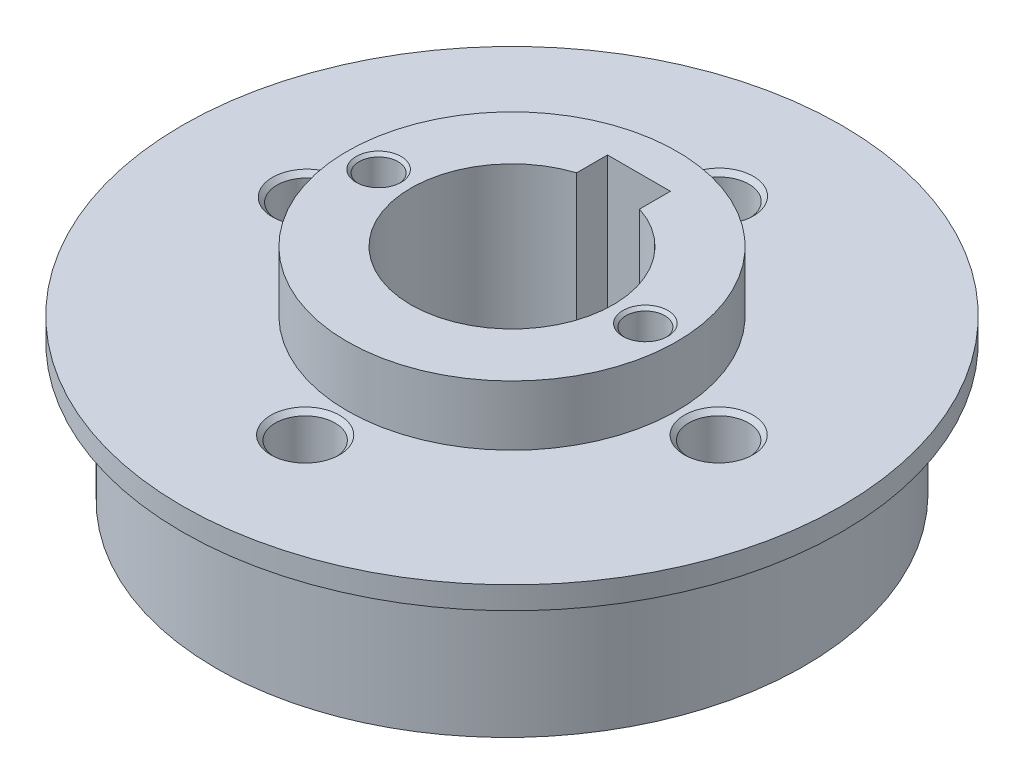
ISO-10303-21;
HEADER;
FILE_DESCRIPTION(('STEP AP214'),'2;1');
FILE_NAME('part.step','',(''),(''),'','','');
FILE_SCHEMA(('AUTOMOTIVE_DESIGN { 1 0 10303 214 1 1 1 1 }'));
ENDSEC;
DATA;
#1=APPLICATION_CONTEXT('core data for automotive mechanical design processes');
#2=APPLICATION_PROTOCOL_DEFINITION('international standard','automotive_design',2000,#1);
#3=PRODUCT_CONTEXT('',#1,'mechanical');
#4=PRODUCT('Part','Part','',(#3));
#5=PRODUCT_RELATED_PRODUCT_CATEGORY('part','',(#4));
#6=PRODUCT_DEFINITION_FORMATION('','',#4);
#7=PRODUCT_DEFINITION_CONTEXT('part definition',#1,'design');
#8=PRODUCT_DEFINITION('design','',#6,#7);
#9=PRODUCT_DEFINITION_SHAPE('','',#8);
#10=(LENGTH_UNIT() NAMED_UNIT(*) SI_UNIT(.MILLI.,.METRE.));
#11=(NAMED_UNIT(*) PLANE_ANGLE_UNIT() SI_UNIT($,.RADIAN.));
#12=(NAMED_UNIT(*) SI_UNIT($,.STERADIAN.) SOLID_ANGLE_UNIT());
#13=UNCERTAINTY_MEASURE_WITH_UNIT(LENGTH_MEASURE(1.E-05),#10,'distance_accuracy_value','');
#14=(GEOMETRIC_REPRESENTATION_CONTEXT(3) GLOBAL_UNCERTAINTY_ASSIGNED_CONTEXT((#13)) GLOBAL_UNIT_ASSIGNED_CONTEXT((#10,
#11,#12)) REPRESENTATION_CONTEXT('',''));
#15=CARTESIAN_POINT('',(0.,0.,0.));
#16=DIRECTION('',(0.,0.,1.));
#17=DIRECTION('',(1.,0.,0.));
#18=AXIS2_PLACEMENT_3D('',#15,#16,#17);
#19=CARTESIAN_POINT('',(0.,13.,0.));
#20=DIRECTION('',(0.,-1.,0.));
#21=DIRECTION('',(0.,0.,1.));
#22=AXIS2_PLACEMENT_3D('',#19,#20,#21);
#23=ELLIPSE('',#22,19.75,19.5);
#24=DIRECTION('',(0.,-1.,0.));
#25=VECTOR('',#24,1.);
#26=SURFACE_OF_LINEAR_EXTRUSION('',#23,#25);
#27=CARTESIAN_POINT('',(0.,13.,19.75));
#28=VERTEX_POINT('',#27);
#29=EDGE_CURVE('E123',#28,#28,#23,.T.);
#30=ORIENTED_EDGE('',*,*,#29,.T.);
#31=EDGE_LOOP('',(#30));
#32=FACE_BOUND('',#31,.T.);
#33=CARTESIAN_POINT('',(0.,4.,0.));
#34=DIRECTION('',(0.,-1.,0.));
#35=DIRECTION('',(0.,0.,1.));
#36=AXIS2_PLACEMENT_3D('',#33,#34,#35);
#37=ELLIPSE('',#36,19.75,19.5);
#38=CARTESIAN_POINT('',(0.,4.,19.75));
#39=VERTEX_POINT('',#38);
#40=EDGE_CURVE('E120',#39,#39,#37,.F.);
#41=ORIENTED_EDGE('',*,*,#40,.T.);
#42=EDGE_LOOP('',(#41));
#43=FACE_BOUND('',#42,.T.);
#44=ADVANCED_FACE('F36',(#32,#43),#26,.T.);
#45=CARTESIAN_POINT('',(0.,18.5,0.));
#46=DIRECTION('',(0.,-1.,0.));
#47=DIRECTION('',(0.,0.,-1.));
#48=AXIS2_PLACEMENT_3D('',#45,#46,#47);
#49=CYLINDRICAL_SURFACE('',#48,22.);
#50=CARTESIAN_POINT('',(0.,14.5,0.));
#51=DIRECTION('',(0.,1.,0.));
#52=DIRECTION('',(0.,0.,1.));
#53=AXIS2_PLACEMENT_3D('',#50,#51,#52);
#54=CIRCLE('',#53,22.);
#55=CARTESIAN_POINT('',(0.,14.5,22.));
#56=VERTEX_POINT('',#55);
#57=EDGE_CURVE('E226',#56,#56,#54,.T.);
#58=ORIENTED_EDGE('',*,*,#57,.F.);
#59=EDGE_LOOP('',(#58));
#60=FACE_BOUND('',#59,.T.);
#61=CARTESIAN_POINT('',(0.,13.,0.));
#62=DIRECTION('',(0.,-1.,0.));
#63=DIRECTION('',(0.,0.,-1.));
#64=AXIS2_PLACEMENT_3D('',#61,#62,#63);
#65=CIRCLE('',#64,22.);
#66=CARTESIAN_POINT('',(0.,13.,-22.));
#67=VERTEX_POINT('',#66);
#68=EDGE_CURVE('E127',#67,#67,#65,.T.);
#69=ORIENTED_EDGE('',*,*,#68,.F.);
#70=EDGE_LOOP('',(#69));
#71=FACE_BOUND('',#70,.T.);
#72=ADVANCED_FACE('F133',(#60,#71),#49,.T.);
#73=CARTESIAN_POINT('',(0.,14.5,0.));
#74=DIRECTION('',(0.,1.,0.));
#75=DIRECTION('',(0.,0.,1.));
#76=AXIS2_PLACEMENT_3D('',#73,#74,#75);
#77=PLANE('',#76);
#78=CARTESIAN_POINT('',(-13.6907550695712,14.5,0.));
#79=DIRECTION('',(0.,1.,0.));
#80=DIRECTION('',(0.,0.,1.));
#81=AXIS2_PLACEMENT_3D('',#78,#79,#80);
#82=CIRCLE('',#81,2.29389999999999);
#83=CARTESIAN_POINT('',(-13.6907550695712,14.5,2.29389999999999));
#84=VERTEX_POINT('',#83);
#85=EDGE_CURVE('E206',#84,#84,#82,.F.);
#86=ORIENTED_EDGE('',*,*,#85,.T.);
#87=EDGE_LOOP('',(#86));
#88=FACE_BOUND('',#87,.T.);
#89=CARTESIAN_POINT('',(0.,14.5,13.8010392563542));
#90=DIRECTION('',(0.,1.,0.));
#91=DIRECTION('',(0.,0.,1.));
#92=AXIS2_PLACEMENT_3D('',#89,#90,#91);
#93=CIRCLE('',#92,2.29390000000002);
#94=CARTESIAN_POINT('',(0.,14.5,16.0949392563542));
#95=VERTEX_POINT('',#94);
#96=EDGE_CURVE('E211',#95,#95,#93,.F.);
#97=ORIENTED_EDGE('',*,*,#96,.T.);
#98=EDGE_LOOP('',(#97));
#99=FACE_BOUND('',#98,.T.);
#100=CARTESIAN_POINT('',(13.7899190054415,14.5,0.));
#101=DIRECTION('',(0.,1.,0.));
#102=DIRECTION('',(0.,0.,1.));
#103=AXIS2_PLACEMENT_3D('',#100,#101,#102);
#104=CIRCLE('',#103,2.29389999999999);
#105=CARTESIAN_POINT('',(13.7899190054415,14.5,2.29389999999999));
#106=VERTEX_POINT('',#105);
#107=EDGE_CURVE('E272',#106,#106,#104,.F.);
#108=ORIENTED_EDGE('',*,*,#107,.T.);
#109=EDGE_LOOP('',(#108));
#110=FACE_BOUND('',#109,.T.);
#111=CARTESIAN_POINT('',(0.,14.5,-13.8102883154971));
#112=DIRECTION('',(0.,1.,0.));
#113=DIRECTION('',(0.,0.,1.));
#114=AXIS2_PLACEMENT_3D('',#111,#112,#113);
#115=CIRCLE('',#114,2.29389999999999);
#116=CARTESIAN_POINT('',(0.,14.5,-11.5163883154971));
#117=VERTEX_POINT('',#116);
#118=EDGE_CURVE('E269',#117,#117,#115,.F.);
#119=ORIENTED_EDGE('',*,*,#118,.T.);
#120=EDGE_LOOP('',(#119));
#121=FACE_BOUND('',#120,.T.);
#122=CARTESIAN_POINT('',(0.,14.5,0.));
#123=DIRECTION('',(0.,1.,0.));
#124=DIRECTION('',(0.,0.,1.));
#125=AXIS2_PLACEMENT_3D('',#122,#123,#124);
#126=CIRCLE('',#125,11.);
#127=CARTESIAN_POINT('',(0.,14.5,11.));
#128=VERTEX_POINT('',#127);
#129=EDGE_CURVE('E223',#128,#128,#126,.T.);
#130=ORIENTED_EDGE('',*,*,#129,.F.);
#131=EDGE_LOOP('',(#130));
#132=FACE_BOUND('',#131,.T.);
#133=ORIENTED_EDGE('',*,*,#57,.T.);
#134=EDGE_LOOP('',(#133));
#135=FACE_BOUND('',#134,.T.);
#136=ADVANCED_FACE('F145',(#88,#99,#110,#121,#132,#135),#77,.T.);
#137=CARTESIAN_POINT('',(0.,14.5,0.));
#138=DIRECTION('',(0.,1.,0.));
#139=DIRECTION('',(0.,0.,1.));
#140=AXIS2_PLACEMENT_3D('',#137,#138,#139);
#141=CYLINDRICAL_SURFACE('',#140,11.);
#142=ORIENTED_EDGE('',*,*,#129,.T.);
#143=EDGE_LOOP('',(#142));
#144=FACE_BOUND('',#143,.T.);
#145=CARTESIAN_POINT('',(0.,18.5,0.));
#146=DIRECTION('',(0.,1.,0.));
#147=DIRECTION('',(0.,0.,1.));
#148=AXIS2_PLACEMENT_3D('',#145,#146,#147);
#149=CIRCLE('',#148,11.);
#150=CARTESIAN_POINT('',(0.,18.5,11.));
#151=VERTEX_POINT('',#150);
#152=EDGE_CURVE('E221',#151,#151,#149,.T.);
#153=ORIENTED_EDGE('',*,*,#152,.F.);
#154=EDGE_LOOP('',(#153));
#155=FACE_BOUND('',#154,.T.);
#156=ADVANCED_FACE('F142',(#144,#155),#141,.T.);
#157=CARTESIAN_POINT('',(0.,18.5,0.));
#158=DIRECTION('',(0.,1.,0.));
#159=DIRECTION('',(0.,0.,1.));
#160=AXIS2_PLACEMENT_3D('',#157,#158,#159);
#161=PLANE('',#160);
#162=CARTESIAN_POINT('',(-8.9,18.5,0.));
#163=DIRECTION('',(0.,1.,0.));
#164=DIRECTION('',(0.,0.,1.));
#165=AXIS2_PLACEMENT_3D('',#162,#163,#164);
#166=CIRCLE('',#165,1.5);
#167=CARTESIAN_POINT('',(-8.9,18.5,1.5));
#168=VERTEX_POINT('',#167);
#169=EDGE_CURVE('E44',#168,#168,#166,.F.);
#170=ORIENTED_EDGE('',*,*,#169,.T.);
#171=EDGE_LOOP('',(#170));
#172=FACE_BOUND('',#171,.T.);
#173=CARTESIAN_POINT('',(8.9,18.5,0.));
#174=DIRECTION('',(0.,1.,0.));
#175=DIRECTION('',(0.,0.,1.));
#176=AXIS2_PLACEMENT_3D('',#173,#174,#175);
#177=CIRCLE('',#176,1.5);
#178=CARTESIAN_POINT('',(8.9,18.5,1.5));
#179=VERTEX_POINT('',#178);
#180=EDGE_CURVE('E205',#179,#179,#177,.F.);
#181=ORIENTED_EDGE('',*,*,#180,.T.);
#182=EDGE_LOOP('',(#181));
#183=FACE_BOUND('',#182,.T.);
#184=CARTESIAN_POINT('',(0.,18.5,0.));
#185=DIRECTION('',(0.,1.,0.));
#186=DIRECTION('',(0.,0.,1.));
#187=AXIS2_PLACEMENT_3D('',#184,#185,#186);
#188=CIRCLE('',#187,6.75);
#189=CARTESIAN_POINT('',(-2.09759968355261,18.5,-6.415806696555));
#190=VERTEX_POINT('',#189);
#191=CARTESIAN_POINT('',(2.09759968355261,18.5,-6.415806696555));
#192=VERTEX_POINT('',#191);
#193=EDGE_CURVE('E51',#190,#192,#188,.T.);
#194=ORIENTED_EDGE('',*,*,#193,.F.);
#195=DIRECTION('',(0.,0.,1.));
#196=VECTOR('',#195,1.);
#197=CARTESIAN_POINT('',(-2.09759968355261,18.5,-8.47124520737506));
#198=LINE('',#197,#196);
#199=CARTESIAN_POINT('',(-2.09759968355261,18.5,-8.47124520737506));
#200=VERTEX_POINT('',#199);
#201=EDGE_CURVE('E95',#200,#190,#198,.T.);
#202=ORIENTED_EDGE('',*,*,#201,.F.);
#203=DIRECTION('',(-1.,0.,0.));
#204=VECTOR('',#203,1.);
#205=CARTESIAN_POINT('',(-2.09759968355261,18.5,-8.47124520737506));
#206=LINE('',#205,#204);
#207=CARTESIAN_POINT('',(2.09759968355261,18.5,-8.47124520737506));
#208=VERTEX_POINT('',#207);
#209=EDGE_CURVE('E98',#208,#200,#206,.T.);
#210=ORIENTED_EDGE('',*,*,#209,.F.);
#211=DIRECTION('',(0.,0.,-1.));
#212=VECTOR('',#211,1.);
#213=CARTESIAN_POINT('',(2.09759968355261,18.5,-8.47124520737506));
#214=LINE('',#213,#212);
#215=EDGE_CURVE('E107',#192,#208,#214,.T.);
#216=ORIENTED_EDGE('',*,*,#215,.F.);
#217=EDGE_LOOP('',(#194,#202,#210,#216));
#218=FACE_BOUND('',#217,.T.);
#219=ORIENTED_EDGE('',*,*,#152,.T.);
#220=EDGE_LOOP('',(#219));
#221=FACE_BOUND('',#220,.T.);
#222=ADVANCED_FACE('F140',(#172,#183,#218,#221),#161,.T.);
#223=CARTESIAN_POINT('',(0.,13.,0.));
#224=DIRECTION('',(0.,-1.,0.));
#225=DIRECTION('',(0.,0.,-1.));
#226=AXIS2_PLACEMENT_3D('',#223,#224,#225);
#227=PLANE('',#226);
#228=ORIENTED_EDGE('',*,*,#29,.F.);
#229=EDGE_LOOP('',(#228));
#230=FACE_BOUND('',#229,.T.);
#231=ORIENTED_EDGE('',*,*,#68,.T.);
#232=EDGE_LOOP('',(#231));
#233=FACE_BOUND('',#232,.T.);
#234=ADVANCED_FACE('F137',(#230,#233),#227,.T.);
#235=CARTESIAN_POINT('',(0.,4.,0.));
#236=DIRECTION('',(0.,-1.,0.));
#237=DIRECTION('',(0.,0.,-1.));
#238=AXIS2_PLACEMENT_3D('',#235,#236,#237);
#239=PLANE('',#238);
#240=CARTESIAN_POINT('',(0.,4.,-13.8102883154971));
#241=DIRECTION('',(0.,-1.,0.));
#242=DIRECTION('',(0.,0.,-1.));
#243=AXIS2_PLACEMENT_3D('',#240,#241,#242);
#244=CIRCLE('',#243,2.2939);
#245=CARTESIAN_POINT('',(0.,4.,-16.1041883154971));
#246=VERTEX_POINT('',#245);
#247=EDGE_CURVE('E248',#246,#246,#244,.F.);
#248=ORIENTED_EDGE('',*,*,#247,.T.);
#249=EDGE_LOOP('',(#248));
#250=FACE_BOUND('',#249,.T.);
#251=CARTESIAN_POINT('',(-13.6907550695712,4.,0.));
#252=DIRECTION('',(0.,-1.,0.));
#253=DIRECTION('',(0.,0.,-1.));
#254=AXIS2_PLACEMENT_3D('',#251,#252,#253);
#255=CIRCLE('',#254,2.2939);
#256=CARTESIAN_POINT('',(-13.6907550695712,4.,-2.2939));
#257=VERTEX_POINT('',#256);
#258=EDGE_CURVE('E245',#257,#257,#255,.F.);
#259=ORIENTED_EDGE('',*,*,#258,.T.);
#260=EDGE_LOOP('',(#259));
#261=FACE_BOUND('',#260,.T.);
#262=CARTESIAN_POINT('',(0.,4.,13.8010392563542));
#263=DIRECTION('',(0.,-1.,0.));
#264=DIRECTION('',(0.,0.,-1.));
#265=AXIS2_PLACEMENT_3D('',#262,#263,#264);
#266=CIRCLE('',#265,2.2939);
#267=CARTESIAN_POINT('',(0.,4.,11.5071392563542));
#268=VERTEX_POINT('',#267);
#269=EDGE_CURVE('E242',#268,#268,#266,.F.);
#270=ORIENTED_EDGE('',*,*,#269,.T.);
#271=EDGE_LOOP('',(#270));
#272=FACE_BOUND('',#271,.T.);
#273=CARTESIAN_POINT('',(13.7899190054415,4.,0.));
#274=DIRECTION('',(0.,-1.,0.));
#275=DIRECTION('',(0.,0.,-1.));
#276=AXIS2_PLACEMENT_3D('',#273,#274,#275);
#277=CIRCLE('',#276,2.2939);
#278=CARTESIAN_POINT('',(13.7899190054415,4.,-2.2939));
#279=VERTEX_POINT('',#278);
#280=EDGE_CURVE('E239',#279,#279,#277,.F.);
#281=ORIENTED_EDGE('',*,*,#280,.T.);
#282=EDGE_LOOP('',(#281));
#283=FACE_BOUND('',#282,.T.);
#284=ORIENTED_EDGE('',*,*,#40,.F.);
#285=EDGE_LOOP('',(#284));
#286=FACE_BOUND('',#285,.T.);
#287=CARTESIAN_POINT('',(0.,4.,0.));
#288=DIRECTION('',(0.,-1.,0.));
#289=DIRECTION('',(0.,0.,-1.));
#290=AXIS2_PLACEMENT_3D('',#287,#288,#289);
#291=CIRCLE('',#290,11.);
#292=CARTESIAN_POINT('',(0.,4.,-11.));
#293=VERTEX_POINT('',#292);
#294=EDGE_CURVE('E117',#293,#293,#291,.T.);
#295=ORIENTED_EDGE('',*,*,#294,.F.);
#296=EDGE_LOOP('',(#295));
#297=FACE_BOUND('',#296,.T.);
#298=ADVANCED_FACE('F135',(#250,#261,#272,#283,#286,#297),#239,.T.);
#299=CARTESIAN_POINT('',(0.,4.,0.));
#300=DIRECTION('',(0.,-1.,0.));
#301=DIRECTION('',(0.,0.,-1.));
#302=AXIS2_PLACEMENT_3D('',#299,#300,#301);
#303=CYLINDRICAL_SURFACE('',#302,11.);
#304=ORIENTED_EDGE('',*,*,#294,.T.);
#305=EDGE_LOOP('',(#304));
#306=FACE_BOUND('',#305,.T.);
#307=CARTESIAN_POINT('',(0.,0.,0.));
#308=DIRECTION('',(0.,-1.,0.));
#309=DIRECTION('',(0.,0.,-1.));
#310=AXIS2_PLACEMENT_3D('',#307,#308,#309);
#311=CIRCLE('',#310,11.);
#312=CARTESIAN_POINT('',(0.,0.,-11.));
#313=VERTEX_POINT('',#312);
#314=EDGE_CURVE('E113',#313,#313,#311,.T.);
#315=ORIENTED_EDGE('',*,*,#314,.F.);
#316=EDGE_LOOP('',(#315));
#317=FACE_BOUND('',#316,.T.);
#318=ADVANCED_FACE('F155',(#306,#317),#303,.T.);
#319=CARTESIAN_POINT('',(0.,0.,0.));
#320=DIRECTION('',(0.,1.,0.));
#321=DIRECTION('',(0.,0.,1.));
#322=AXIS2_PLACEMENT_3D('',#319,#320,#321);
#323=PLANE('',#322);
#324=DIRECTION('',(0.,0.,1.));
#325=VECTOR('',#324,1.);
#326=CARTESIAN_POINT('',(-2.09759968355261,0.,-8.47124520737506));
#327=LINE('',#326,#325);
#328=CARTESIAN_POINT('',(-2.09759968355261,0.,-8.47124520737506));
#329=VERTEX_POINT('',#328);
#330=CARTESIAN_POINT('',(-2.09759968355261,0.,-6.415806696555));
#331=VERTEX_POINT('',#330);
#332=EDGE_CURVE('E85',#329,#331,#327,.T.);
#333=ORIENTED_EDGE('',*,*,#332,.T.);
#334=CARTESIAN_POINT('',(0.,0.,0.));
#335=DIRECTION('',(0.,1.,0.));
#336=DIRECTION('',(0.,0.,1.));
#337=AXIS2_PLACEMENT_3D('',#334,#335,#336);
#338=CIRCLE('',#337,6.75);
#339=CARTESIAN_POINT('',(2.09759968355261,0.,-6.415806696555));
#340=VERTEX_POINT('',#339);
#341=EDGE_CURVE('E79',#331,#340,#338,.T.);
#342=ORIENTED_EDGE('',*,*,#341,.T.);
#343=DIRECTION('',(0.,0.,-1.));
#344=VECTOR('',#343,1.);
#345=CARTESIAN_POINT('',(2.09759968355261,0.,-8.47124520737506));
#346=LINE('',#345,#344);
#347=CARTESIAN_POINT('',(2.09759968355261,0.,-8.47124520737506));
#348=VERTEX_POINT('',#347);
#349=EDGE_CURVE('E88',#340,#348,#346,.T.);
#350=ORIENTED_EDGE('',*,*,#349,.T.);
#351=DIRECTION('',(-1.,0.,0.));
#352=VECTOR('',#351,1.);
#353=CARTESIAN_POINT('',(-2.09759968355261,0.,-8.47124520737506));
#354=LINE('',#353,#352);
#355=EDGE_CURVE('E59',#348,#329,#354,.T.);
#356=ORIENTED_EDGE('',*,*,#355,.T.);
#357=EDGE_LOOP('',(#333,#342,#350,#356));
#358=FACE_BOUND('',#357,.T.);
#359=ORIENTED_EDGE('',*,*,#314,.T.);
#360=EDGE_LOOP('',(#359));
#361=FACE_BOUND('',#360,.T.);
#362=ADVANCED_FACE('F92',(#358,#361),#323,.F.);
#363=CARTESIAN_POINT('',(0.,0.,0.));
#364=DIRECTION('',(0.,1.,0.));
#365=DIRECTION('',(0.,0.,1.));
#366=AXIS2_PLACEMENT_3D('',#363,#364,#365);
#367=CYLINDRICAL_SURFACE('',#366,6.75);
#368=ORIENTED_EDGE('',*,*,#193,.T.);
#369=DIRECTION('',(0.,1.,0.));
#370=VECTOR('',#369,1.);
#371=CARTESIAN_POINT('',(2.09759968355261,0.,-6.415806696555));
#372=LINE('',#371,#370);
#373=EDGE_CURVE('E75',#340,#192,#372,.T.);
#374=ORIENTED_EDGE('',*,*,#373,.F.);
#375=ORIENTED_EDGE('',*,*,#341,.F.);
#376=DIRECTION('',(0.,1.,0.));
#377=VECTOR('',#376,1.);
#378=CARTESIAN_POINT('',(-2.09759968355261,0.,-6.415806696555));
#379=LINE('',#378,#377);
#380=EDGE_CURVE('E111',#331,#190,#379,.T.);
#381=ORIENTED_EDGE('',*,*,#380,.T.);
#382=EDGE_LOOP('',(#368,#374,#375,#381));
#383=FACE_BOUND('',#382,.T.);
#384=ADVANCED_FACE('F77',(#383),#367,.F.);
#385=CARTESIAN_POINT('',(-2.09759968355261,0.,-8.47124520737506));
#386=DIRECTION('',(-1.,0.,0.));
#387=DIRECTION('',(0.,0.,1.));
#388=AXIS2_PLACEMENT_3D('',#385,#386,#387);
#389=PLANE('',#388);
#390=ORIENTED_EDGE('',*,*,#201,.T.);
#391=ORIENTED_EDGE('',*,*,#380,.F.);
#392=ORIENTED_EDGE('',*,*,#332,.F.);
#393=DIRECTION('',(0.,1.,0.));
#394=VECTOR('',#393,1.);
#395=CARTESIAN_POINT('',(-2.09759968355261,0.,-8.47124520737506));
#396=LINE('',#395,#394);
#397=EDGE_CURVE('E114',#329,#200,#396,.T.);
#398=ORIENTED_EDGE('',*,*,#397,.T.);
#399=EDGE_LOOP('',(#390,#391,#392,#398));
#400=FACE_BOUND('',#399,.T.);
#401=ADVANCED_FACE('F298',(#400),#389,.F.);
#402=CARTESIAN_POINT('',(-2.09759968355261,0.,-8.47124520737506));
#403=DIRECTION('',(0.,0.,-1.));
#404=DIRECTION('',(-1.,0.,0.));
#405=AXIS2_PLACEMENT_3D('',#402,#403,#404);
#406=PLANE('',#405);
#407=ORIENTED_EDGE('',*,*,#209,.T.);
#408=ORIENTED_EDGE('',*,*,#397,.F.);
#409=ORIENTED_EDGE('',*,*,#355,.F.);
#410=DIRECTION('',(0.,1.,0.));
#411=VECTOR('',#410,1.);
#412=CARTESIAN_POINT('',(2.09759968355261,0.,-8.47124520737506));
#413=LINE('',#412,#411);
#414=EDGE_CURVE('E84',#348,#208,#413,.T.);
#415=ORIENTED_EDGE('',*,*,#414,.T.);
#416=EDGE_LOOP('',(#407,#408,#409,#415));
#417=FACE_BOUND('',#416,.T.);
#418=ADVANCED_FACE('F301',(#417),#406,.F.);
#419=CARTESIAN_POINT('',(2.09759968355261,0.,-8.47124520737506));
#420=DIRECTION('',(1.,0.,0.));
#421=DIRECTION('',(0.,0.,-1.));
#422=AXIS2_PLACEMENT_3D('',#419,#420,#421);
#423=PLANE('',#422);
#424=ORIENTED_EDGE('',*,*,#215,.T.);
#425=ORIENTED_EDGE('',*,*,#414,.F.);
#426=ORIENTED_EDGE('',*,*,#349,.F.);
#427=ORIENTED_EDGE('',*,*,#373,.T.);
#428=EDGE_LOOP('',(#424,#425,#426,#427));
#429=FACE_BOUND('',#428,.T.);
#430=ADVANCED_FACE('F89',(#429),#423,.F.);
#431=CARTESIAN_POINT('',(-13.6907550695712,14.5,0.));
#432=DIRECTION('',(0.,1.,0.));
#433=DIRECTION('',(0.,0.,1.));
#434=AXIS2_PLACEMENT_3D('',#431,#432,#433);
#435=CYLINDRICAL_SURFACE('',#434,1.99389999999999);
#436=CARTESIAN_POINT('',(-13.6907550695712,4.30000000000001,0.));
#437=DIRECTION('',(0.,-1.,0.));
#438=DIRECTION('',(0.,0.,-1.));
#439=AXIS2_PLACEMENT_3D('',#436,#437,#438);
#440=CIRCLE('',#439,1.99389999999999);
#441=CARTESIAN_POINT('',(-13.6907550695712,4.30000000000001,-1.99389999999999));
#442=VERTEX_POINT('',#441);
#443=EDGE_CURVE('E254',#442,#442,#440,.T.);
#444=ORIENTED_EDGE('',*,*,#443,.T.);
#445=EDGE_LOOP('',(#444));
#446=FACE_BOUND('',#445,.T.);
#447=CARTESIAN_POINT('',(-13.6907550695712,14.2,0.));
#448=DIRECTION('',(0.,1.,0.));
#449=DIRECTION('',(0.,0.,1.));
#450=AXIS2_PLACEMENT_3D('',#447,#448,#449);
#451=CIRCLE('',#450,1.99389999999999);
#452=CARTESIAN_POINT('',(-13.6907550695712,14.2,1.99389999999999));
#453=VERTEX_POINT('',#452);
#454=EDGE_CURVE('E251',#453,#453,#451,.T.);
#455=ORIENTED_EDGE('',*,*,#454,.T.);
#456=EDGE_LOOP('',(#455));
#457=FACE_BOUND('',#456,.T.);
#458=ADVANCED_FACE('F284',(#446,#457),#435,.F.);
#459=CARTESIAN_POINT('',(0.,14.5,13.8010392563542));
#460=DIRECTION('',(0.,1.,0.));
#461=DIRECTION('',(0.,0.,1.));
#462=AXIS2_PLACEMENT_3D('',#459,#460,#461);
#463=CYLINDRICAL_SURFACE('',#462,1.99389999999999);
#464=CARTESIAN_POINT('',(0.,4.30000000000001,13.8010392563542));
#465=DIRECTION('',(0.,-1.,0.));
#466=DIRECTION('',(0.,0.,-1.));
#467=AXIS2_PLACEMENT_3D('',#464,#465,#466);
#468=CIRCLE('',#467,1.99389999999999);
#469=CARTESIAN_POINT('',(0.,4.30000000000001,11.8071392563542));
#470=VERTEX_POINT('',#469);
#471=EDGE_CURVE('E260',#470,#470,#468,.T.);
#472=ORIENTED_EDGE('',*,*,#471,.T.);
#473=EDGE_LOOP('',(#472));
#474=FACE_BOUND('',#473,.T.);
#475=CARTESIAN_POINT('',(0.,14.2,13.8010392563542));
#476=DIRECTION('',(0.,1.,0.));
#477=DIRECTION('',(0.,0.,1.));
#478=AXIS2_PLACEMENT_3D('',#475,#476,#477);
#479=CIRCLE('',#478,1.99389999999999);
#480=CARTESIAN_POINT('',(0.,14.2,15.7949392563542));
#481=VERTEX_POINT('',#480);
#482=EDGE_CURVE('E257',#481,#481,#479,.T.);
#483=ORIENTED_EDGE('',*,*,#482,.T.);
#484=EDGE_LOOP('',(#483));
#485=FACE_BOUND('',#484,.T.);
#486=ADVANCED_FACE('F281',(#474,#485),#463,.F.);
#487=CARTESIAN_POINT('',(13.7899190054415,14.5,0.));
#488=DIRECTION('',(0.,1.,0.));
#489=DIRECTION('',(0.,0.,1.));
#490=AXIS2_PLACEMENT_3D('',#487,#488,#489);
#491=CYLINDRICAL_SURFACE('',#490,1.99389999999999);
#492=CARTESIAN_POINT('',(13.7899190054415,4.30000000000001,0.));
#493=DIRECTION('',(0.,-1.,0.));
#494=DIRECTION('',(0.,0.,-1.));
#495=AXIS2_PLACEMENT_3D('',#492,#493,#494);
#496=CIRCLE('',#495,1.99389999999999);
#497=CARTESIAN_POINT('',(13.7899190054415,4.30000000000001,-1.99389999999999));
#498=VERTEX_POINT('',#497);
#499=EDGE_CURVE('E266',#498,#498,#496,.T.);
#500=ORIENTED_EDGE('',*,*,#499,.T.);
#501=EDGE_LOOP('',(#500));
#502=FACE_BOUND('',#501,.T.);
#503=CARTESIAN_POINT('',(13.7899190054415,14.2,0.));
#504=DIRECTION('',(0.,1.,0.));
#505=DIRECTION('',(0.,0.,1.));
#506=AXIS2_PLACEMENT_3D('',#503,#504,#505);
#507=CIRCLE('',#506,1.99389999999999);
#508=CARTESIAN_POINT('',(13.7899190054415,14.2,1.99389999999999));
#509=VERTEX_POINT('',#508);
#510=EDGE_CURVE('E263',#509,#509,#507,.T.);
#511=ORIENTED_EDGE('',*,*,#510,.T.);
#512=EDGE_LOOP('',(#511));
#513=FACE_BOUND('',#512,.T.);
#514=ADVANCED_FACE('F283',(#502,#513),#491,.F.);
#515=CARTESIAN_POINT('',(0.,14.5,-13.8102883154971));
#516=DIRECTION('',(0.,1.,0.));
#517=DIRECTION('',(0.,0.,1.));
#518=AXIS2_PLACEMENT_3D('',#515,#516,#517);
#519=CYLINDRICAL_SURFACE('',#518,1.99389999999999);
#520=CARTESIAN_POINT('',(0.,4.30000000000001,-13.8102883154971));
#521=DIRECTION('',(0.,-1.,0.));
#522=DIRECTION('',(0.,0.,-1.));
#523=AXIS2_PLACEMENT_3D('',#520,#521,#522);
#524=CIRCLE('',#523,1.99389999999999);
#525=CARTESIAN_POINT('',(0.,4.30000000000001,-15.8041883154971));
#526=VERTEX_POINT('',#525);
#527=EDGE_CURVE('E236',#526,#526,#524,.T.);
#528=ORIENTED_EDGE('',*,*,#527,.T.);
#529=EDGE_LOOP('',(#528));
#530=FACE_BOUND('',#529,.T.);
#531=CARTESIAN_POINT('',(0.,14.2,-13.8102883154971));
#532=DIRECTION('',(0.,1.,0.));
#533=DIRECTION('',(0.,0.,1.));
#534=AXIS2_PLACEMENT_3D('',#531,#532,#533);
#535=CIRCLE('',#534,1.99389999999999);
#536=CARTESIAN_POINT('',(0.,14.2,-11.8163883154971));
#537=VERTEX_POINT('',#536);
#538=EDGE_CURVE('E231',#537,#537,#535,.T.);
#539=ORIENTED_EDGE('',*,*,#538,.T.);
#540=EDGE_LOOP('',(#539));
#541=FACE_BOUND('',#540,.T.);
#542=ADVANCED_FACE('F291',(#530,#541),#519,.F.);
#543=CARTESIAN_POINT('',(8.9,16.,0.));
#544=DIRECTION('',(0.,1.,0.));
#545=DIRECTION('',(0.,0.,1.));
#546=AXIS2_PLACEMENT_3D('',#543,#544,#545);
#547=CYLINDRICAL_SURFACE('',#546,1.3);
#548=CARTESIAN_POINT('',(8.9,18.3,0.));
#549=DIRECTION('',(0.,1.,0.));
#550=DIRECTION('',(0.,0.,1.));
#551=AXIS2_PLACEMENT_3D('',#548,#549,#550);
#552=CIRCLE('',#551,1.3);
#553=CARTESIAN_POINT('',(8.9,18.3,1.3));
#554=VERTEX_POINT('',#553);
#555=EDGE_CURVE('E11',#554,#554,#552,.T.);
#556=ORIENTED_EDGE('',*,*,#555,.T.);
#557=EDGE_LOOP('',(#556));
#558=FACE_BOUND('',#557,.T.);
#559=CARTESIAN_POINT('',(8.9,16.,0.));
#560=DIRECTION('',(0.,1.,0.));
#561=DIRECTION('',(0.,0.,1.));
#562=AXIS2_PLACEMENT_3D('',#559,#560,#561);
#563=CIRCLE('',#562,1.3);
#564=CARTESIAN_POINT('',(8.9,16.,1.3));
#565=VERTEX_POINT('',#564);
#566=EDGE_CURVE('E101',#565,#565,#563,.T.);
#567=ORIENTED_EDGE('',*,*,#566,.F.);
#568=EDGE_LOOP('',(#567));
#569=FACE_BOUND('',#568,.T.);
#570=ADVANCED_FACE('F347',(#558,#569),#547,.F.);
#571=CARTESIAN_POINT('',(8.9,16.,0.));
#572=DIRECTION('',(0.,1.,0.));
#573=DIRECTION('',(0.,0.,1.));
#574=AXIS2_PLACEMENT_3D('',#571,#572,#573);
#575=PLANE('',#574);
#576=ORIENTED_EDGE('',*,*,#566,.T.);
#577=EDGE_LOOP('',(#576));
#578=FACE_BOUND('',#577,.T.);
#579=ADVANCED_FACE('F353',(#578),#575,.T.);
#580=CARTESIAN_POINT('',(-8.9,16.,0.));
#581=DIRECTION('',(0.,1.,0.));
#582=DIRECTION('',(0.,0.,1.));
#583=AXIS2_PLACEMENT_3D('',#580,#581,#582);
#584=CYLINDRICAL_SURFACE('',#583,1.3);
#585=CARTESIAN_POINT('',(-8.9,18.3,0.));
#586=DIRECTION('',(0.,1.,0.));
#587=DIRECTION('',(0.,0.,1.));
#588=AXIS2_PLACEMENT_3D('',#585,#586,#587);
#589=CIRCLE('',#588,1.3);
#590=CARTESIAN_POINT('',(-8.9,18.3,1.3));
#591=VERTEX_POINT('',#590);
#592=EDGE_CURVE('E203',#591,#591,#589,.T.);
#593=ORIENTED_EDGE('',*,*,#592,.T.);
#594=EDGE_LOOP('',(#593));
#595=FACE_BOUND('',#594,.T.);
#596=CARTESIAN_POINT('',(-8.9,16.,0.));
#597=DIRECTION('',(0.,1.,0.));
#598=DIRECTION('',(0.,0.,1.));
#599=AXIS2_PLACEMENT_3D('',#596,#597,#598);
#600=CIRCLE('',#599,1.3);
#601=CARTESIAN_POINT('',(-8.9,16.,1.3));
#602=VERTEX_POINT('',#601);
#603=EDGE_CURVE('E369',#602,#602,#600,.T.);
#604=ORIENTED_EDGE('',*,*,#603,.F.);
#605=EDGE_LOOP('',(#604));
#606=FACE_BOUND('',#605,.T.);
#607=ADVANCED_FACE('F359',(#595,#606),#584,.F.);
#608=CARTESIAN_POINT('',(-8.9,16.,0.));
#609=DIRECTION('',(0.,1.,0.));
#610=DIRECTION('',(0.,0.,1.));
#611=AXIS2_PLACEMENT_3D('',#608,#609,#610);
#612=PLANE('',#611);
#613=ORIENTED_EDGE('',*,*,#603,.T.);
#614=EDGE_LOOP('',(#613));
#615=FACE_BOUND('',#614,.T.);
#616=ADVANCED_FACE('F163',(#615),#612,.T.);
#617=CARTESIAN_POINT('',(0.,4.30000000000001,-13.8102883154971));
#618=DIRECTION('',(0.,-1.,0.));
#619=DIRECTION('',(0.,0.,-1.));
#620=AXIS2_PLACEMENT_3D('',#617,#618,#619);
#621=CONICAL_SURFACE('',#620,1.99389999999999,0.785398163397452);
#622=ORIENTED_EDGE('',*,*,#247,.F.);
#623=EDGE_LOOP('',(#622));
#624=FACE_BOUND('',#623,.T.);
#625=ORIENTED_EDGE('',*,*,#527,.F.);
#626=EDGE_LOOP('',(#625));
#627=FACE_BOUND('',#626,.T.);
#628=ADVANCED_FACE('F159',(#624,#627),#621,.F.);
#629=CARTESIAN_POINT('',(-13.6907550695712,4.30000000000001,0.));
#630=DIRECTION('',(0.,-1.,0.));
#631=DIRECTION('',(0.,0.,-1.));
#632=AXIS2_PLACEMENT_3D('',#629,#630,#631);
#633=CONICAL_SURFACE('',#632,1.99389999999999,0.785398163397453);
#634=ORIENTED_EDGE('',*,*,#258,.F.);
#635=EDGE_LOOP('',(#634));
#636=FACE_BOUND('',#635,.T.);
#637=ORIENTED_EDGE('',*,*,#443,.F.);
#638=EDGE_LOOP('',(#637));
#639=FACE_BOUND('',#638,.T.);
#640=ADVANCED_FACE('F162',(#636,#639),#633,.F.);
#641=CARTESIAN_POINT('',(0.,4.30000000000001,13.8010392563542));
#642=DIRECTION('',(0.,-1.,0.));
#643=DIRECTION('',(0.,0.,-1.));
#644=AXIS2_PLACEMENT_3D('',#641,#642,#643);
#645=CONICAL_SURFACE('',#644,1.99389999999999,0.785398163397452);
#646=ORIENTED_EDGE('',*,*,#269,.F.);
#647=EDGE_LOOP('',(#646));
#648=FACE_BOUND('',#647,.T.);
#649=ORIENTED_EDGE('',*,*,#471,.F.);
#650=EDGE_LOOP('',(#649));
#651=FACE_BOUND('',#650,.T.);
#652=ADVANCED_FACE('F167',(#648,#651),#645,.F.);
#653=CARTESIAN_POINT('',(13.7899190054415,4.30000000000001,0.));
#654=DIRECTION('',(0.,-1.,0.));
#655=DIRECTION('',(0.,0.,-1.));
#656=AXIS2_PLACEMENT_3D('',#653,#654,#655);
#657=CONICAL_SURFACE('',#656,1.99389999999999,0.785398163397451);
#658=ORIENTED_EDGE('',*,*,#280,.F.);
#659=EDGE_LOOP('',(#658));
#660=FACE_BOUND('',#659,.T.);
#661=ORIENTED_EDGE('',*,*,#499,.F.);
#662=EDGE_LOOP('',(#661));
#663=FACE_BOUND('',#662,.T.);
#664=ADVANCED_FACE('F171',(#660,#663),#657,.F.);
#665=CARTESIAN_POINT('',(-13.6907550695712,14.2,0.));
#666=DIRECTION('',(0.,1.,0.));
#667=DIRECTION('',(0.,0.,1.));
#668=AXIS2_PLACEMENT_3D('',#665,#666,#667);
#669=CONICAL_SURFACE('',#668,1.99389999999999,0.785398163397455);
#670=ORIENTED_EDGE('',*,*,#85,.F.);
#671=EDGE_LOOP('',(#670));
#672=FACE_BOUND('',#671,.T.);
#673=ORIENTED_EDGE('',*,*,#454,.F.);
#674=EDGE_LOOP('',(#673));
#675=FACE_BOUND('',#674,.T.);
#676=ADVANCED_FACE('F175',(#672,#675),#669,.F.);
#677=CARTESIAN_POINT('',(0.,14.2,13.8010392563542));
#678=DIRECTION('',(0.,1.,0.));
#679=DIRECTION('',(0.,0.,1.));
#680=AXIS2_PLACEMENT_3D('',#677,#678,#679);
#681=CONICAL_SURFACE('',#680,1.99389999999999,0.785398163397455);
#682=ORIENTED_EDGE('',*,*,#96,.F.);
#683=EDGE_LOOP('',(#682));
#684=FACE_BOUND('',#683,.T.);
#685=ORIENTED_EDGE('',*,*,#482,.F.);
#686=EDGE_LOOP('',(#685));
#687=FACE_BOUND('',#686,.T.);
#688=ADVANCED_FACE('F179',(#684,#687),#681,.F.);
#689=CARTESIAN_POINT('',(13.7899190054415,14.2,0.));
#690=DIRECTION('',(0.,1.,0.));
#691=DIRECTION('',(0.,0.,1.));
#692=AXIS2_PLACEMENT_3D('',#689,#690,#691);
#693=CONICAL_SURFACE('',#692,1.99389999999999,0.785398163397457);
#694=ORIENTED_EDGE('',*,*,#107,.F.);
#695=EDGE_LOOP('',(#694));
#696=FACE_BOUND('',#695,.T.);
#697=ORIENTED_EDGE('',*,*,#510,.F.);
#698=EDGE_LOOP('',(#697));
#699=FACE_BOUND('',#698,.T.);
#700=ADVANCED_FACE('F183',(#696,#699),#693,.F.);
#701=CARTESIAN_POINT('',(0.,14.2,-13.8102883154971));
#702=DIRECTION('',(0.,1.,0.));
#703=DIRECTION('',(0.,0.,1.));
#704=AXIS2_PLACEMENT_3D('',#701,#702,#703);
#705=CONICAL_SURFACE('',#704,1.99389999999999,0.785398163397455);
#706=ORIENTED_EDGE('',*,*,#118,.F.);
#707=EDGE_LOOP('',(#706));
#708=FACE_BOUND('',#707,.T.);
#709=ORIENTED_EDGE('',*,*,#538,.F.);
#710=EDGE_LOOP('',(#709));
#711=FACE_BOUND('',#710,.T.);
#712=ADVANCED_FACE('F187',(#708,#711),#705,.F.);
#713=CARTESIAN_POINT('',(-8.9,18.3,0.));
#714=DIRECTION('',(0.,1.,0.));
#715=DIRECTION('',(0.,0.,1.));
#716=AXIS2_PLACEMENT_3D('',#713,#714,#715);
#717=CONICAL_SURFACE('',#716,1.3,0.785398163397446);
#718=ORIENTED_EDGE('',*,*,#169,.F.);
#719=EDGE_LOOP('',(#718));
#720=FACE_BOUND('',#719,.T.);
#721=ORIENTED_EDGE('',*,*,#592,.F.);
#722=EDGE_LOOP('',(#721));
#723=FACE_BOUND('',#722,.T.);
#724=ADVANCED_FACE('F190',(#720,#723),#717,.F.);
#725=CARTESIAN_POINT('',(8.9,18.3,0.));
#726=DIRECTION('',(0.,1.,0.));
#727=DIRECTION('',(0.,0.,1.));
#728=AXIS2_PLACEMENT_3D('',#725,#726,#727);
#729=CONICAL_SURFACE('',#728,1.3,0.785398163397446);
#730=ORIENTED_EDGE('',*,*,#180,.F.);
#731=EDGE_LOOP('',(#730));
#732=FACE_BOUND('',#731,.T.);
#733=ORIENTED_EDGE('',*,*,#555,.F.);
#734=EDGE_LOOP('',(#733));
#735=FACE_BOUND('',#734,.T.);
#736=ADVANCED_FACE('F38',(#732,#735),#729,.F.);
#737=CLOSED_SHELL('',(#44,#72,#136,#156,#222,#234,#298,#318,#362,#384,#401,#418,#430,#458,#486,
#514,#542,#570,#579,#607,#616,#628,#640,#652,#664,#676,#688,#700,#712,#724,#736));
#738=MANIFOLD_SOLID_BREP('B2',#737);
#739=ADVANCED_BREP_SHAPE_REPRESENTATION('',(#18,#738),#14);
#740=SHAPE_DEFINITION_REPRESENTATION(#9,#739);
ENDSEC;
END-ISO-10303-21;
